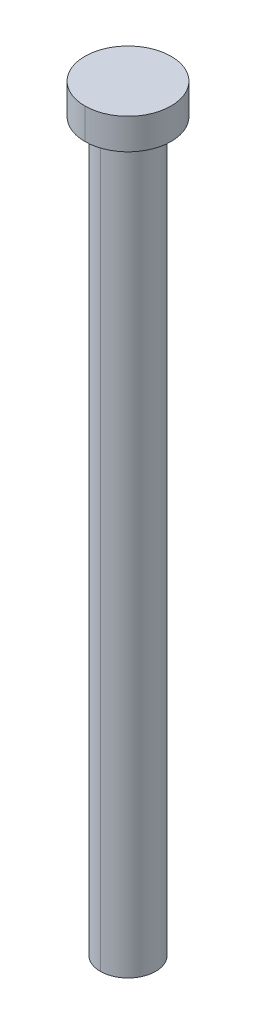
ISO-10303-21;
HEADER;
FILE_DESCRIPTION(('STEP AP214'),'2;1');
FILE_NAME('part.step','',(''),(''),'','','');
FILE_SCHEMA(('AUTOMOTIVE_DESIGN { 1 0 10303 214 1 1 1 1 }'));
ENDSEC;
DATA;
#1=APPLICATION_CONTEXT('core data for automotive mechanical design processes');
#2=APPLICATION_PROTOCOL_DEFINITION('international standard','automotive_design',2000,#1);
#3=PRODUCT_CONTEXT('',#1,'mechanical');
#4=PRODUCT('Part','Part','',(#3));
#5=PRODUCT_RELATED_PRODUCT_CATEGORY('part','',(#4));
#6=PRODUCT_DEFINITION_FORMATION('','',#4);
#7=PRODUCT_DEFINITION_CONTEXT('part definition',#1,'design');
#8=PRODUCT_DEFINITION('design','',#6,#7);
#9=PRODUCT_DEFINITION_SHAPE('','',#8);
#10=(LENGTH_UNIT() NAMED_UNIT(*) SI_UNIT(.MILLI.,.METRE.));
#11=(NAMED_UNIT(*) PLANE_ANGLE_UNIT() SI_UNIT($,.RADIAN.));
#12=(NAMED_UNIT(*) SI_UNIT($,.STERADIAN.) SOLID_ANGLE_UNIT());
#13=UNCERTAINTY_MEASURE_WITH_UNIT(LENGTH_MEASURE(1.E-05),#10,'distance_accuracy_value','');
#14=(GEOMETRIC_REPRESENTATION_CONTEXT(3) GLOBAL_UNCERTAINTY_ASSIGNED_CONTEXT((#13)) GLOBAL_UNIT_ASSIGNED_CONTEXT((#10,
#11,#12)) REPRESENTATION_CONTEXT('',''));
#15=CARTESIAN_POINT('',(0.,0.,0.));
#16=DIRECTION('',(0.,0.,1.));
#17=DIRECTION('',(1.,0.,0.));
#18=AXIS2_PLACEMENT_3D('',#15,#16,#17);
#19=CARTESIAN_POINT('',(-0.35,6.15,0.));
#20=DIRECTION('',(0.,1.,0.));
#21=DIRECTION('',(1.,0.,0.));
#22=AXIS2_PLACEMENT_3D('',#19,#20,#21);
#23=PLANE('',#22);
#24=CARTESIAN_POINT('',(0.,6.15,0.));
#25=DIRECTION('',(0.,1.,0.));
#26=DIRECTION('',(0.,0.,-1.));
#27=AXIS2_PLACEMENT_3D('',#24,#25,#26);
#28=CIRCLE('',#27,0.35);
#29=CARTESIAN_POINT('',(0.,6.15,-0.35));
#30=VERTEX_POINT('',#29);
#31=CARTESIAN_POINT('',(0.,6.15,0.35));
#32=VERTEX_POINT('',#31);
#33=EDGE_CURVE('E11',#30,#32,#28,.T.);
#34=ORIENTED_EDGE('',*,*,#33,.T.);
#35=CARTESIAN_POINT('',(0.,6.15,0.));
#36=DIRECTION('',(0.,1.,0.));
#37=DIRECTION('',(0.,0.,1.));
#38=AXIS2_PLACEMENT_3D('',#35,#36,#37);
#39=CIRCLE('',#38,0.35);
#40=EDGE_CURVE('E70',#32,#30,#39,.T.);
#41=ORIENTED_EDGE('',*,*,#40,.T.);
#42=EDGE_LOOP('',(#34,#41));
#43=FACE_BOUND('',#42,.T.);
#44=ADVANCED_FACE('F16',(#43),#23,.T.);
#45=CARTESIAN_POINT('',(0.,6.15,0.));
#46=DIRECTION('',(0.,1.,0.));
#47=DIRECTION('',(0.,0.,1.));
#48=AXIS2_PLACEMENT_3D('',#45,#46,#47);
#49=CYLINDRICAL_SURFACE('',#48,0.35);
#50=CARTESIAN_POINT('',(0.,5.9,0.));
#51=DIRECTION('',(0.,-1.,0.));
#52=DIRECTION('',(0.,0.,1.));
#53=AXIS2_PLACEMENT_3D('',#50,#51,#52);
#54=CIRCLE('',#53,0.35);
#55=CARTESIAN_POINT('',(0.,5.9,0.35));
#56=VERTEX_POINT('',#55);
#57=CARTESIAN_POINT('',(0.,5.9,-0.35));
#58=VERTEX_POINT('',#57);
#59=EDGE_CURVE('E77',#56,#58,#54,.T.);
#60=ORIENTED_EDGE('',*,*,#59,.F.);
#61=DIRECTION('',(0.,-1.,0.));
#62=VECTOR('',#61,1.);
#63=CARTESIAN_POINT('',(0.,6.15,0.35));
#64=LINE('',#63,#62);
#65=EDGE_CURVE('E27',#32,#56,#64,.T.);
#66=ORIENTED_EDGE('',*,*,#65,.F.);
#67=ORIENTED_EDGE('',*,*,#33,.F.);
#68=DIRECTION('',(0.,-1.,0.));
#69=VECTOR('',#68,1.);
#70=CARTESIAN_POINT('',(0.,6.15,-0.35));
#71=LINE('',#70,#69);
#72=EDGE_CURVE('E79',#30,#58,#71,.T.);
#73=ORIENTED_EDGE('',*,*,#72,.T.);
#74=EDGE_LOOP('',(#60,#66,#67,#73));
#75=FACE_BOUND('',#74,.T.);
#76=ADVANCED_FACE('F81',(#75),#49,.T.);
#77=CARTESIAN_POINT('',(0.,6.15,0.));
#78=DIRECTION('',(0.,1.,0.));
#79=DIRECTION('',(0.,0.,1.));
#80=AXIS2_PLACEMENT_3D('',#77,#78,#79);
#81=CYLINDRICAL_SURFACE('',#80,0.35);
#82=ORIENTED_EDGE('',*,*,#72,.F.);
#83=ORIENTED_EDGE('',*,*,#40,.F.);
#84=ORIENTED_EDGE('',*,*,#65,.T.);
#85=CARTESIAN_POINT('',(0.,5.9,0.));
#86=DIRECTION('',(0.,-1.,0.));
#87=DIRECTION('',(0.,0.,-1.));
#88=AXIS2_PLACEMENT_3D('',#85,#86,#87);
#89=CIRCLE('',#88,0.35);
#90=EDGE_CURVE('E68',#58,#56,#89,.T.);
#91=ORIENTED_EDGE('',*,*,#90,.F.);
#92=EDGE_LOOP('',(#82,#83,#84,#91));
#93=FACE_BOUND('',#92,.T.);
#94=ADVANCED_FACE('F67',(#93),#81,.T.);
#95=CARTESIAN_POINT('',(-0.225,5.9,0.));
#96=DIRECTION('',(0.,-1.,0.));
#97=DIRECTION('',(0.,0.,-1.));
#98=AXIS2_PLACEMENT_3D('',#95,#96,#97);
#99=PLANE('',#98);
#100=CARTESIAN_POINT('',(0.,5.9,0.));
#101=DIRECTION('',(0.,1.,0.));
#102=DIRECTION('',(0.,0.,-1.));
#103=AXIS2_PLACEMENT_3D('',#100,#101,#102);
#104=CIRCLE('',#103,0.225);
#105=CARTESIAN_POINT('',(0.,5.9,-0.225));
#106=VERTEX_POINT('',#105);
#107=CARTESIAN_POINT('',(0.,5.9,0.225));
#108=VERTEX_POINT('',#107);
#109=EDGE_CURVE('E83',#106,#108,#104,.T.);
#110=ORIENTED_EDGE('',*,*,#109,.T.);
#111=CARTESIAN_POINT('',(0.,5.9,0.));
#112=DIRECTION('',(0.,1.,0.));
#113=DIRECTION('',(0.,0.,1.));
#114=AXIS2_PLACEMENT_3D('',#111,#112,#113);
#115=CIRCLE('',#114,0.225);
#116=EDGE_CURVE('E93',#108,#106,#115,.T.);
#117=ORIENTED_EDGE('',*,*,#116,.T.);
#118=EDGE_LOOP('',(#110,#117));
#119=FACE_BOUND('',#118,.T.);
#120=ORIENTED_EDGE('',*,*,#59,.T.);
#121=ORIENTED_EDGE('',*,*,#90,.T.);
#122=EDGE_LOOP('',(#120,#121));
#123=FACE_BOUND('',#122,.T.);
#124=ADVANCED_FACE('F76',(#119,#123),#99,.T.);
#125=CARTESIAN_POINT('',(0.,6.15,0.));
#126=DIRECTION('',(0.,1.,0.));
#127=DIRECTION('',(0.,0.,1.));
#128=AXIS2_PLACEMENT_3D('',#125,#126,#127);
#129=CYLINDRICAL_SURFACE('',#128,0.225);
#130=CARTESIAN_POINT('',(0.,0.,0.));
#131=DIRECTION('',(0.,-1.,0.));
#132=DIRECTION('',(0.,0.,1.));
#133=AXIS2_PLACEMENT_3D('',#130,#131,#132);
#134=CIRCLE('',#133,0.225);
#135=CARTESIAN_POINT('',(0.,0.,0.225));
#136=VERTEX_POINT('',#135);
#137=CARTESIAN_POINT('',(0.,0.,-0.225));
#138=VERTEX_POINT('',#137);
#139=EDGE_CURVE('E96',#136,#138,#134,.T.);
#140=ORIENTED_EDGE('',*,*,#139,.F.);
#141=DIRECTION('',(0.,-1.,0.));
#142=VECTOR('',#141,1.);
#143=CARTESIAN_POINT('',(0.,5.9,0.225));
#144=LINE('',#143,#142);
#145=EDGE_CURVE('E90',#108,#136,#144,.T.);
#146=ORIENTED_EDGE('',*,*,#145,.F.);
#147=ORIENTED_EDGE('',*,*,#109,.F.);
#148=DIRECTION('',(0.,-1.,0.));
#149=VECTOR('',#148,1.);
#150=CARTESIAN_POINT('',(0.,5.9,-0.225));
#151=LINE('',#150,#149);
#152=EDGE_CURVE('E20',#106,#138,#151,.T.);
#153=ORIENTED_EDGE('',*,*,#152,.T.);
#154=EDGE_LOOP('',(#140,#146,#147,#153));
#155=FACE_BOUND('',#154,.T.);
#156=ADVANCED_FACE('F18',(#155),#129,.T.);
#157=CARTESIAN_POINT('',(0.,6.15,0.));
#158=DIRECTION('',(0.,1.,0.));
#159=DIRECTION('',(0.,0.,1.));
#160=AXIS2_PLACEMENT_3D('',#157,#158,#159);
#161=CYLINDRICAL_SURFACE('',#160,0.225);
#162=ORIENTED_EDGE('',*,*,#152,.F.);
#163=ORIENTED_EDGE('',*,*,#116,.F.);
#164=ORIENTED_EDGE('',*,*,#145,.T.);
#165=CARTESIAN_POINT('',(0.,0.,0.));
#166=DIRECTION('',(0.,-1.,0.));
#167=DIRECTION('',(0.,0.,-1.));
#168=AXIS2_PLACEMENT_3D('',#165,#166,#167);
#169=CIRCLE('',#168,0.225);
#170=EDGE_CURVE('E100',#138,#136,#169,.T.);
#171=ORIENTED_EDGE('',*,*,#170,.F.);
#172=EDGE_LOOP('',(#162,#163,#164,#171));
#173=FACE_BOUND('',#172,.T.);
#174=ADVANCED_FACE('F118',(#173),#161,.T.);
#175=CARTESIAN_POINT('',(0.,0.,0.));
#176=DIRECTION('',(0.,-1.,0.));
#177=DIRECTION('',(0.,0.,-1.));
#178=AXIS2_PLACEMENT_3D('',#175,#176,#177);
#179=PLANE('',#178);
#180=ORIENTED_EDGE('',*,*,#139,.T.);
#181=ORIENTED_EDGE('',*,*,#170,.T.);
#182=EDGE_LOOP('',(#180,#181));
#183=FACE_BOUND('',#182,.T.);
#184=ADVANCED_FACE('F115',(#183),#179,.T.);
#185=CLOSED_SHELL('',(#44,#76,#94,#124,#156,#174,#184));
#186=MANIFOLD_SOLID_BREP('B1',#185);
#187=ADVANCED_BREP_SHAPE_REPRESENTATION('',(#18,#186),#14);
#188=SHAPE_DEFINITION_REPRESENTATION(#9,#187);
ENDSEC;
END-ISO-10303-21;
